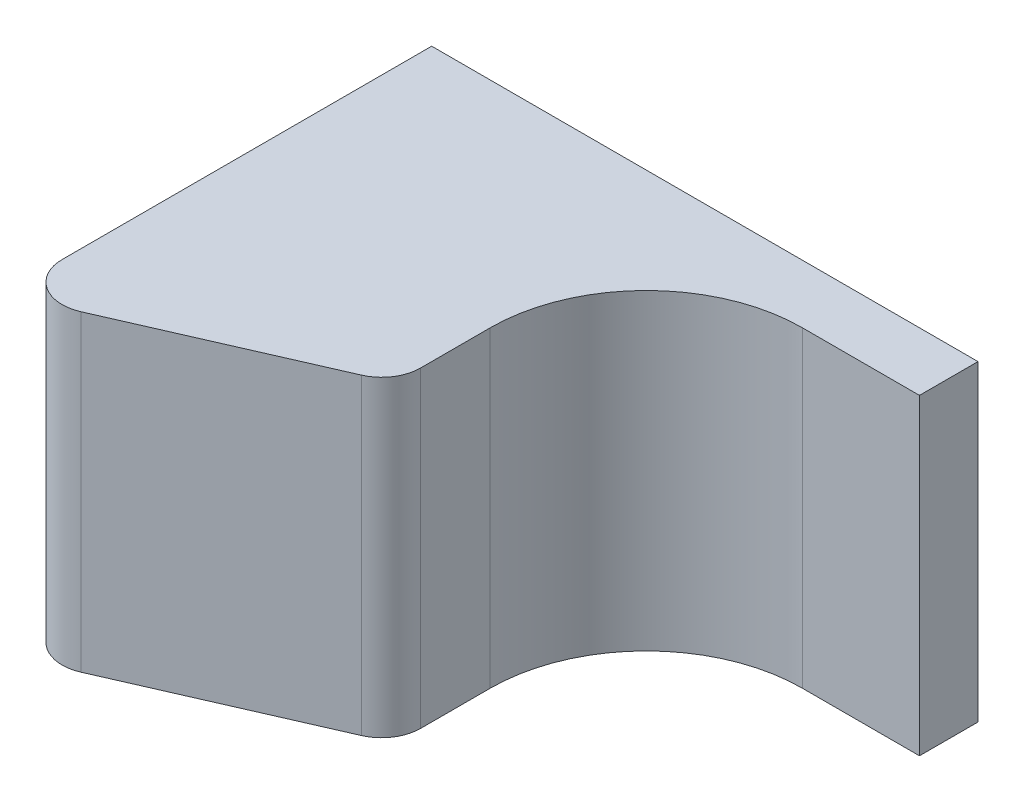
ISO-10303-21;
HEADER;
FILE_DESCRIPTION(('STEP AP214'),'2;1');
FILE_NAME('part.step','',(''),(''),'','','');
FILE_SCHEMA(('AUTOMOTIVE_DESIGN { 1 0 10303 214 1 1 1 1 }'));
ENDSEC;
DATA;
#1=APPLICATION_CONTEXT('core data for automotive mechanical design processes');
#2=APPLICATION_PROTOCOL_DEFINITION('international standard','automotive_design',2000,#1);
#3=PRODUCT_CONTEXT('',#1,'mechanical');
#4=PRODUCT('Part','Part','',(#3));
#5=PRODUCT_RELATED_PRODUCT_CATEGORY('part','',(#4));
#6=PRODUCT_DEFINITION_FORMATION('','',#4);
#7=PRODUCT_DEFINITION_CONTEXT('part definition',#1,'design');
#8=PRODUCT_DEFINITION('design','',#6,#7);
#9=PRODUCT_DEFINITION_SHAPE('','',#8);
#10=(LENGTH_UNIT() NAMED_UNIT(*) SI_UNIT(.MILLI.,.METRE.));
#11=(NAMED_UNIT(*) PLANE_ANGLE_UNIT() SI_UNIT($,.RADIAN.));
#12=(NAMED_UNIT(*) SI_UNIT($,.STERADIAN.) SOLID_ANGLE_UNIT());
#13=UNCERTAINTY_MEASURE_WITH_UNIT(LENGTH_MEASURE(1.E-05),#10,'distance_accuracy_value','');
#14=(GEOMETRIC_REPRESENTATION_CONTEXT(3) GLOBAL_UNCERTAINTY_ASSIGNED_CONTEXT((#13)) GLOBAL_UNIT_ASSIGNED_CONTEXT((#10,
#11,#12)) REPRESENTATION_CONTEXT('',''));
#15=CARTESIAN_POINT('',(0.,0.,0.));
#16=DIRECTION('',(0.,0.,1.));
#17=DIRECTION('',(1.,0.,0.));
#18=AXIS2_PLACEMENT_3D('',#15,#16,#17);
#19=CARTESIAN_POINT('',(7.,7.35,16.5));
#20=DIRECTION('',(-1.,0.,0.));
#21=DIRECTION('',(0.,0.,1.));
#22=AXIS2_PLACEMENT_3D('',#19,#20,#21);
#23=PLANE('',#22);
#24=DIRECTION('',(0.,0.,-1.));
#25=VECTOR('',#24,1.);
#26=CARTESIAN_POINT('',(7.,-0.649999999999996,16.5));
#27=LINE('',#26,#25);
#28=CARTESIAN_POINT('',(7.,-0.649999999999996,12.7834844252142));
#29=VERTEX_POINT('',#28);
#30=CARTESIAN_POINT('',(7.,-0.649999999999996,11.));
#31=VERTEX_POINT('',#30);
#32=EDGE_CURVE('E149',#29,#31,#27,.T.);
#33=ORIENTED_EDGE('',*,*,#32,.T.);
#34=DIRECTION('',(0.,-1.,0.));
#35=VECTOR('',#34,1.);
#36=CARTESIAN_POINT('',(7.,7.35,11.));
#37=LINE('',#36,#35);
#38=CARTESIAN_POINT('',(7.,7.35,11.));
#39=VERTEX_POINT('',#38);
#40=EDGE_CURVE('E54',#31,#39,#37,.F.);
#41=ORIENTED_EDGE('',*,*,#40,.T.);
#42=DIRECTION('',(0.,0.,-1.));
#43=VECTOR('',#42,1.);
#44=CARTESIAN_POINT('',(7.,7.35,16.5));
#45=LINE('',#44,#43);
#46=CARTESIAN_POINT('',(7.,7.35,12.7834844252142));
#47=VERTEX_POINT('',#46);
#48=EDGE_CURVE('E147',#47,#39,#45,.T.);
#49=ORIENTED_EDGE('',*,*,#48,.F.);
#50=DIRECTION('',(0.,1.,0.));
#51=VECTOR('',#50,1.);
#52=CARTESIAN_POINT('',(7.,7.35,12.7834844252142));
#53=LINE('',#52,#51);
#54=EDGE_CURVE('E169',#47,#29,#53,.F.);
#55=ORIENTED_EDGE('',*,*,#54,.T.);
#56=EDGE_LOOP('',(#33,#41,#49,#55));
#57=FACE_BOUND('',#56,.T.);
#58=ADVANCED_FACE('F33',(#57),#23,.F.);
#59=CARTESIAN_POINT('',(0.,7.35,16.5));
#60=DIRECTION('',(1.,0.,0.));
#61=DIRECTION('',(0.,1.,0.));
#62=AXIS2_PLACEMENT_3D('',#59,#60,#61);
#63=PLANE('',#62);
#64=DIRECTION('',(0.,0.,-1.));
#65=VECTOR('',#64,1.);
#66=CARTESIAN_POINT('',(0.,-0.649999999999997,16.5));
#67=LINE('',#66,#65);
#68=CARTESIAN_POINT('',(0.,-0.649999999999997,14.9709844252142));
#69=VERTEX_POINT('',#68);
#70=CARTESIAN_POINT('',(0.,-0.649999999999997,5.5));
#71=VERTEX_POINT('',#70);
#72=EDGE_CURVE('E151',#69,#71,#67,.T.);
#73=ORIENTED_EDGE('',*,*,#72,.F.);
#74=DIRECTION('',(0.,-1.,0.));
#75=VECTOR('',#74,1.);
#76=CARTESIAN_POINT('',(0.,7.35,14.9709844252142));
#77=LINE('',#76,#75);
#78=CARTESIAN_POINT('',(0.,7.35,14.9709844252142));
#79=VERTEX_POINT('',#78);
#80=EDGE_CURVE('E163',#69,#79,#77,.F.);
#81=ORIENTED_EDGE('',*,*,#80,.T.);
#82=DIRECTION('',(0.,0.,-1.));
#83=VECTOR('',#82,1.);
#84=CARTESIAN_POINT('',(0.,7.35,16.5));
#85=LINE('',#84,#83);
#86=CARTESIAN_POINT('',(0.,7.35,5.5));
#87=VERTEX_POINT('',#86);
#88=EDGE_CURVE('E115',#79,#87,#85,.T.);
#89=ORIENTED_EDGE('',*,*,#88,.T.);
#90=DIRECTION('',(0.,-1.,0.));
#91=VECTOR('',#90,1.);
#92=CARTESIAN_POINT('',(0.,7.35,5.5));
#93=LINE('',#92,#91);
#94=EDGE_CURVE('E112',#87,#71,#93,.T.);
#95=ORIENTED_EDGE('',*,*,#94,.T.);
#96=EDGE_LOOP('',(#73,#81,#89,#95));
#97=FACE_BOUND('',#96,.T.);
#98=ADVANCED_FACE('F184',(#97),#63,.F.);
#99=CARTESIAN_POINT('',(0.,-0.649999999999997,16.5));
#100=DIRECTION('',(0.,1.,0.));
#101=DIRECTION('',(-1.,0.,0.));
#102=AXIS2_PLACEMENT_3D('',#99,#100,#101);
#103=PLANE('',#102);
#104=DIRECTION('',(0.916157334902189,0.,-0.400818834019708));
#105=VECTOR('',#104,1.);
#106=CARTESIAN_POINT('',(16.,-0.649999999999994,9.5));
#107=LINE('',#106,#105);
#108=CARTESIAN_POINT('',(1.40081883401971,-0.649999999999997,15.8871417601164));
#109=VERTEX_POINT('',#108);
#110=CARTESIAN_POINT('',(6.40081883401971,-0.649999999999996,13.6996417601164));
#111=VERTEX_POINT('',#110);
#112=EDGE_CURVE('E141',#109,#111,#107,.T.);
#113=ORIENTED_EDGE('',*,*,#112,.F.);
#114=CARTESIAN_POINT('',(1.,-0.649999999999998,14.9709844252142));
#115=DIRECTION('',(0.,1.,0.));
#116=DIRECTION('',(-1.,0.,0.));
#117=AXIS2_PLACEMENT_3D('',#114,#115,#116);
#118=CIRCLE('',#117,1.);
#119=EDGE_CURVE('E161',#109,#69,#118,.F.);
#120=ORIENTED_EDGE('',*,*,#119,.T.);
#121=ORIENTED_EDGE('',*,*,#72,.T.);
#122=DIRECTION('',(1.,0.,0.));
#123=VECTOR('',#122,1.);
#124=CARTESIAN_POINT('',(0.,-0.649999999999997,5.5));
#125=LINE('',#124,#123);
#126=CARTESIAN_POINT('',(14.,-0.649999999999996,5.5));
#127=VERTEX_POINT('',#126);
#128=EDGE_CURVE('E116',#71,#127,#125,.T.);
#129=ORIENTED_EDGE('',*,*,#128,.T.);
#130=DIRECTION('',(0.,0.,-1.));
#131=VECTOR('',#130,1.);
#132=CARTESIAN_POINT('',(14.,-0.649999999999996,5.5));
#133=LINE('',#132,#131);
#134=CARTESIAN_POINT('',(14.,-0.649999999999996,7.));
#135=VERTEX_POINT('',#134);
#136=EDGE_CURVE('E130',#135,#127,#133,.T.);
#137=ORIENTED_EDGE('',*,*,#136,.F.);
#138=DIRECTION('',(-1.,0.,0.));
#139=VECTOR('',#138,1.);
#140=CARTESIAN_POINT('',(14.,-0.649999999999996,7.));
#141=LINE('',#140,#139);
#142=CARTESIAN_POINT('',(11.,-0.649999999999996,7.));
#143=VERTEX_POINT('',#142);
#144=EDGE_CURVE('E135',#135,#143,#141,.T.);
#145=ORIENTED_EDGE('',*,*,#144,.T.);
#146=CARTESIAN_POINT('',(11.,-0.649999999999996,11.));
#147=DIRECTION('',(0.,1.,0.));
#148=DIRECTION('',(-1.,0.,0.));
#149=AXIS2_PLACEMENT_3D('',#146,#147,#148);
#150=CIRCLE('',#149,4.);
#151=EDGE_CURVE('E41',#143,#31,#150,.T.);
#152=ORIENTED_EDGE('',*,*,#151,.T.);
#153=ORIENTED_EDGE('',*,*,#32,.F.);
#154=CARTESIAN_POINT('',(6.,-0.649999999999998,12.7834844252142));
#155=DIRECTION('',(0.,1.,0.));
#156=DIRECTION('',(-1.,0.,0.));
#157=AXIS2_PLACEMENT_3D('',#154,#155,#156);
#158=CIRCLE('',#157,1.);
#159=EDGE_CURVE('E159',#29,#111,#158,.F.);
#160=ORIENTED_EDGE('',*,*,#159,.T.);
#161=EDGE_LOOP('',(#113,#120,#121,#129,#137,#145,#152,#153,#160));
#162=FACE_BOUND('',#161,.T.);
#163=ADVANCED_FACE('F181',(#162),#103,.F.);
#164=CARTESIAN_POINT('',(0.,7.35,16.5));
#165=DIRECTION('',(0.,-1.,0.));
#166=DIRECTION('',(0.,0.,-1.));
#167=AXIS2_PLACEMENT_3D('',#164,#165,#166);
#168=PLANE('',#167);
#169=ORIENTED_EDGE('',*,*,#88,.F.);
#170=CARTESIAN_POINT('',(1.,7.35,14.9709844252142));
#171=DIRECTION('',(0.,-1.,0.));
#172=DIRECTION('',(0.,0.,-1.));
#173=AXIS2_PLACEMENT_3D('',#170,#171,#172);
#174=CIRCLE('',#173,1.);
#175=CARTESIAN_POINT('',(1.40081883401971,7.35,15.8871417601164));
#176=VERTEX_POINT('',#175);
#177=EDGE_CURVE('E167',#79,#176,#174,.F.);
#178=ORIENTED_EDGE('',*,*,#177,.T.);
#179=DIRECTION('',(-0.916157334902189,0.,0.400818834019708));
#180=VECTOR('',#179,1.);
#181=CARTESIAN_POINT('',(16.,7.35,9.5));
#182=LINE('',#181,#180);
#183=CARTESIAN_POINT('',(6.40081883401971,7.35,13.6996417601164));
#184=VERTEX_POINT('',#183);
#185=EDGE_CURVE('E138',#184,#176,#182,.T.);
#186=ORIENTED_EDGE('',*,*,#185,.F.);
#187=CARTESIAN_POINT('',(6.,7.35,12.7834844252142));
#188=DIRECTION('',(0.,-1.,0.));
#189=DIRECTION('',(0.,0.,-1.));
#190=AXIS2_PLACEMENT_3D('',#187,#188,#189);
#191=CIRCLE('',#190,1.);
#192=EDGE_CURVE('E165',#184,#47,#191,.F.);
#193=ORIENTED_EDGE('',*,*,#192,.T.);
#194=ORIENTED_EDGE('',*,*,#48,.T.);
#195=CARTESIAN_POINT('',(11.,7.35,11.));
#196=DIRECTION('',(0.,-1.,0.));
#197=DIRECTION('',(0.,0.,-1.));
#198=AXIS2_PLACEMENT_3D('',#195,#196,#197);
#199=CIRCLE('',#198,4.);
#200=CARTESIAN_POINT('',(11.,7.35,7.));
#201=VERTEX_POINT('',#200);
#202=EDGE_CURVE('E11',#39,#201,#199,.T.);
#203=ORIENTED_EDGE('',*,*,#202,.T.);
#204=DIRECTION('',(-1.,0.,0.));
#205=VECTOR('',#204,1.);
#206=CARTESIAN_POINT('',(14.,7.35,7.));
#207=LINE('',#206,#205);
#208=CARTESIAN_POINT('',(14.,7.35,7.));
#209=VERTEX_POINT('',#208);
#210=EDGE_CURVE('E122',#209,#201,#207,.T.);
#211=ORIENTED_EDGE('',*,*,#210,.F.);
#212=DIRECTION('',(0.,0.,1.));
#213=VECTOR('',#212,1.);
#214=CARTESIAN_POINT('',(14.,7.35,5.5));
#215=LINE('',#214,#213);
#216=CARTESIAN_POINT('',(14.,7.35,5.5));
#217=VERTEX_POINT('',#216);
#218=EDGE_CURVE('E119',#217,#209,#215,.T.);
#219=ORIENTED_EDGE('',*,*,#218,.F.);
#220=DIRECTION('',(-1.,0.,0.));
#221=VECTOR('',#220,1.);
#222=CARTESIAN_POINT('',(0.,7.35,5.5));
#223=LINE('',#222,#221);
#224=EDGE_CURVE('E105',#217,#87,#223,.T.);
#225=ORIENTED_EDGE('',*,*,#224,.T.);
#226=EDGE_LOOP('',(#169,#178,#186,#193,#194,#203,#211,#219,#225));
#227=FACE_BOUND('',#226,.T.);
#228=ADVANCED_FACE('F120',(#227),#168,.F.);
#229=CARTESIAN_POINT('',(0.,0.,5.5));
#230=DIRECTION('',(0.,0.,1.));
#231=DIRECTION('',(1.,0.,0.));
#232=AXIS2_PLACEMENT_3D('',#229,#230,#231);
#233=PLANE('',#232);
#234=ORIENTED_EDGE('',*,*,#94,.F.);
#235=ORIENTED_EDGE('',*,*,#224,.F.);
#236=DIRECTION('',(0.,1.,0.));
#237=VECTOR('',#236,1.);
#238=CARTESIAN_POINT('',(14.,7.35,5.5));
#239=LINE('',#238,#237);
#240=EDGE_CURVE('E110',#127,#217,#239,.T.);
#241=ORIENTED_EDGE('',*,*,#240,.F.);
#242=ORIENTED_EDGE('',*,*,#128,.F.);
#243=EDGE_LOOP('',(#234,#235,#241,#242));
#244=FACE_BOUND('',#243,.T.);
#245=ADVANCED_FACE('F107',(#244),#233,.F.);
#246=CARTESIAN_POINT('',(16.,-23.501,9.5));
#247=DIRECTION('',(-0.400818834019708,0.,-0.916157334902189));
#248=DIRECTION('',(-0.916157334902189,0.,0.400818834019708));
#249=AXIS2_PLACEMENT_3D('',#246,#247,#248);
#250=PLANE('',#249);
#251=ORIENTED_EDGE('',*,*,#185,.T.);
#252=DIRECTION('',(0.,-1.,0.));
#253=VECTOR('',#252,1.);
#254=CARTESIAN_POINT('',(1.4008188340197,-23.501,15.8871417601164));
#255=LINE('',#254,#253);
#256=EDGE_CURVE('E156',#176,#109,#255,.T.);
#257=ORIENTED_EDGE('',*,*,#256,.T.);
#258=ORIENTED_EDGE('',*,*,#112,.T.);
#259=DIRECTION('',(0.,1.,0.));
#260=VECTOR('',#259,1.);
#261=CARTESIAN_POINT('',(6.40081883401971,-23.501,13.6996417601164));
#262=LINE('',#261,#260);
#263=EDGE_CURVE('E153',#111,#184,#262,.T.);
#264=ORIENTED_EDGE('',*,*,#263,.T.);
#265=EDGE_LOOP('',(#251,#257,#258,#264));
#266=FACE_BOUND('',#265,.T.);
#267=ADVANCED_FACE('F192',(#266),#250,.F.);
#268=CARTESIAN_POINT('',(0.999999999999992,-23.501,14.9709844252142));
#269=DIRECTION('',(0.,-1.,0.));
#270=DIRECTION('',(1.,0.,0.));
#271=AXIS2_PLACEMENT_3D('',#268,#269,#270);
#272=CYLINDRICAL_SURFACE('',#271,1.);
#273=ORIENTED_EDGE('',*,*,#177,.F.);
#274=ORIENTED_EDGE('',*,*,#80,.F.);
#275=ORIENTED_EDGE('',*,*,#119,.F.);
#276=ORIENTED_EDGE('',*,*,#256,.F.);
#277=EDGE_LOOP('',(#273,#274,#275,#276));
#278=FACE_BOUND('',#277,.T.);
#279=ADVANCED_FACE('F190',(#278),#272,.T.);
#280=CARTESIAN_POINT('',(6.,-23.501,12.7834844252142));
#281=DIRECTION('',(0.,1.,0.));
#282=DIRECTION('',(0.,0.,1.));
#283=AXIS2_PLACEMENT_3D('',#280,#281,#282);
#284=CYLINDRICAL_SURFACE('',#283,1.);
#285=ORIENTED_EDGE('',*,*,#159,.F.);
#286=ORIENTED_EDGE('',*,*,#54,.F.);
#287=ORIENTED_EDGE('',*,*,#192,.F.);
#288=ORIENTED_EDGE('',*,*,#263,.F.);
#289=EDGE_LOOP('',(#285,#286,#287,#288));
#290=FACE_BOUND('',#289,.T.);
#291=ADVANCED_FACE('F197',(#290),#284,.T.);
#292=CARTESIAN_POINT('',(14.,7.35,7.));
#293=DIRECTION('',(0.,0.,-1.));
#294=DIRECTION('',(0.,1.,0.));
#295=AXIS2_PLACEMENT_3D('',#292,#293,#294);
#296=PLANE('',#295);
#297=ORIENTED_EDGE('',*,*,#210,.T.);
#298=DIRECTION('',(0.,-1.,0.));
#299=VECTOR('',#298,1.);
#300=CARTESIAN_POINT('',(11.,-0.649999999999996,7.));
#301=LINE('',#300,#299);
#302=EDGE_CURVE('E171',#201,#143,#301,.T.);
#303=ORIENTED_EDGE('',*,*,#302,.T.);
#304=ORIENTED_EDGE('',*,*,#144,.F.);
#305=DIRECTION('',(0.,-1.,0.));
#306=VECTOR('',#305,1.);
#307=CARTESIAN_POINT('',(14.,7.35,7.));
#308=LINE('',#307,#306);
#309=EDGE_CURVE('E125',#209,#135,#308,.T.);
#310=ORIENTED_EDGE('',*,*,#309,.F.);
#311=EDGE_LOOP('',(#297,#303,#304,#310));
#312=FACE_BOUND('',#311,.T.);
#313=ADVANCED_FACE('F177',(#312),#296,.F.);
#314=CARTESIAN_POINT('',(14.,0.,0.));
#315=DIRECTION('',(-1.,0.,0.));
#316=DIRECTION('',(0.,0.,1.));
#317=AXIS2_PLACEMENT_3D('',#314,#315,#316);
#318=PLANE('',#317);
#319=ORIENTED_EDGE('',*,*,#240,.T.);
#320=ORIENTED_EDGE('',*,*,#218,.T.);
#321=ORIENTED_EDGE('',*,*,#309,.T.);
#322=ORIENTED_EDGE('',*,*,#136,.T.);
#323=EDGE_LOOP('',(#319,#320,#321,#322));
#324=FACE_BOUND('',#323,.T.);
#325=ADVANCED_FACE('F128',(#324),#318,.F.);
#326=CARTESIAN_POINT('',(11.,7.35,11.));
#327=DIRECTION('',(0.,1.,0.));
#328=DIRECTION('',(0.,0.,1.));
#329=AXIS2_PLACEMENT_3D('',#326,#327,#328);
#330=CYLINDRICAL_SURFACE('',#329,4.);
#331=ORIENTED_EDGE('',*,*,#202,.F.);
#332=ORIENTED_EDGE('',*,*,#40,.F.);
#333=ORIENTED_EDGE('',*,*,#151,.F.);
#334=ORIENTED_EDGE('',*,*,#302,.F.);
#335=EDGE_LOOP('',(#331,#332,#333,#334));
#336=FACE_BOUND('',#335,.T.);
#337=ADVANCED_FACE('F35',(#336),#330,.F.);
#338=CLOSED_SHELL('',(#58,#98,#163,#228,#245,#267,#279,#291,#313,#325,#337));
#339=MANIFOLD_SOLID_BREP('B2',#338);
#340=ADVANCED_BREP_SHAPE_REPRESENTATION('',(#18,#339),#14);
#341=SHAPE_DEFINITION_REPRESENTATION(#9,#340);
ENDSEC;
END-ISO-10303-21;
